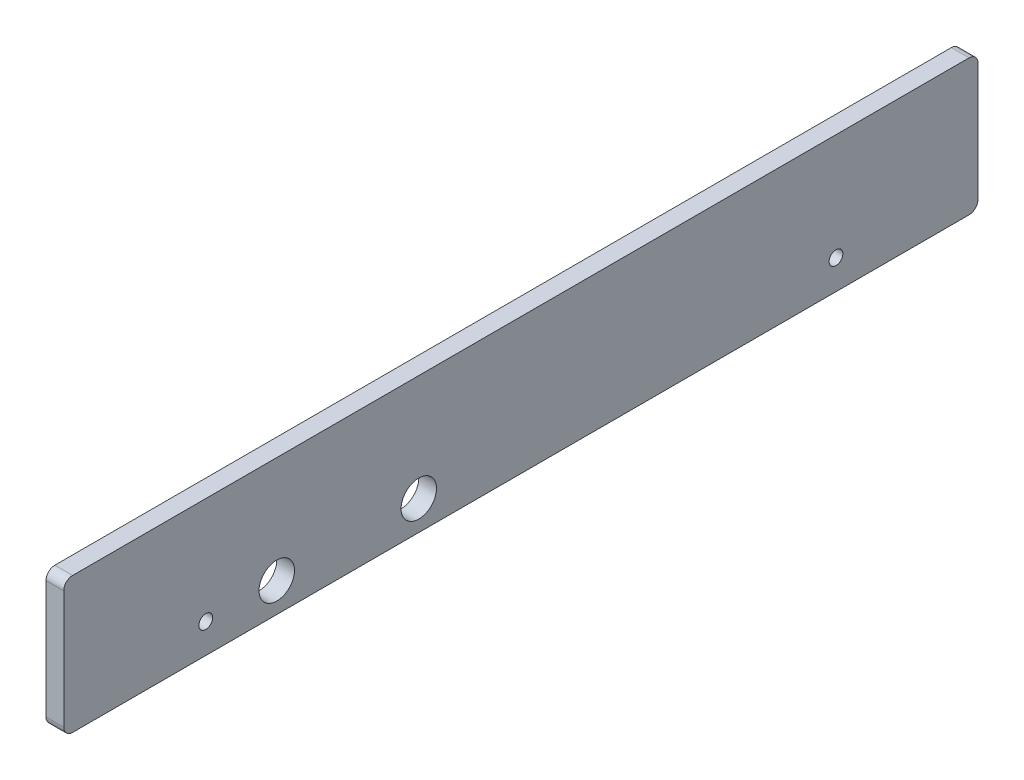
ISO-10303-21;
HEADER;
FILE_DESCRIPTION(('STEP AP214'),'2;1');
FILE_NAME('part.step','',(''),(''),'','','');
FILE_SCHEMA(('AUTOMOTIVE_DESIGN { 1 0 10303 214 1 1 1 1 }'));
ENDSEC;
DATA;
#1=APPLICATION_CONTEXT('core data for automotive mechanical design processes');
#2=APPLICATION_PROTOCOL_DEFINITION('international standard','automotive_design',2000,#1);
#3=PRODUCT_CONTEXT('',#1,'mechanical');
#4=PRODUCT('Part','Part','',(#3));
#5=PRODUCT_RELATED_PRODUCT_CATEGORY('part','',(#4));
#6=PRODUCT_DEFINITION_FORMATION('','',#4);
#7=PRODUCT_DEFINITION_CONTEXT('part definition',#1,'design');
#8=PRODUCT_DEFINITION('design','',#6,#7);
#9=PRODUCT_DEFINITION_SHAPE('','',#8);
#10=(LENGTH_UNIT() NAMED_UNIT(*) SI_UNIT(.MILLI.,.METRE.));
#11=(NAMED_UNIT(*) PLANE_ANGLE_UNIT() SI_UNIT($,.RADIAN.));
#12=(NAMED_UNIT(*) SI_UNIT($,.STERADIAN.) SOLID_ANGLE_UNIT());
#13=UNCERTAINTY_MEASURE_WITH_UNIT(LENGTH_MEASURE(1.E-05),#10,'distance_accuracy_value','');
#14=(GEOMETRIC_REPRESENTATION_CONTEXT(3) GLOBAL_UNCERTAINTY_ASSIGNED_CONTEXT((#13)) GLOBAL_UNIT_ASSIGNED_CONTEXT((#10,
#11,#12)) REPRESENTATION_CONTEXT('',''));
#15=CARTESIAN_POINT('',(0.,0.,0.));
#16=DIRECTION('',(0.,0.,1.));
#17=DIRECTION('',(1.,0.,0.));
#18=AXIS2_PLACEMENT_3D('',#15,#16,#17);
#19=CARTESIAN_POINT('',(6.35,0.,0.));
#20=DIRECTION('',(-1.,0.,0.));
#21=DIRECTION('',(0.,0.,1.));
#22=AXIS2_PLACEMENT_3D('',#19,#20,#21);
#23=PLANE('',#22);
#24=DIRECTION('',(0.,1.,0.));
#25=VECTOR('',#24,1.);
#26=CARTESIAN_POINT('',(6.35,0.,-327.025));
#27=LINE('',#26,#25);
#28=CARTESIAN_POINT('',(6.35,3.175,-327.025));
#29=VERTEX_POINT('',#28);
#30=CARTESIAN_POINT('',(6.35,45.46092,-327.025));
#31=VERTEX_POINT('',#30);
#32=EDGE_CURVE('E172',#29,#31,#27,.T.);
#33=ORIENTED_EDGE('',*,*,#32,.T.);
#34=CARTESIAN_POINT('',(6.35,45.46092,-323.85));
#35=DIRECTION('',(-1.,0.,0.));
#36=DIRECTION('',(0.,0.,1.));
#37=AXIS2_PLACEMENT_3D('',#34,#35,#36);
#38=CIRCLE('',#37,3.175);
#39=CARTESIAN_POINT('',(6.35,48.63592,-323.85));
#40=VERTEX_POINT('',#39);
#41=EDGE_CURVE('E149',#31,#40,#38,.F.);
#42=ORIENTED_EDGE('',*,*,#41,.T.);
#43=DIRECTION('',(0.,0.,1.));
#44=VECTOR('',#43,1.);
#45=CARTESIAN_POINT('',(6.35,48.63592,0.));
#46=LINE('',#45,#44);
#47=CARTESIAN_POINT('',(6.35,48.63592,-3.175));
#48=VERTEX_POINT('',#47);
#49=EDGE_CURVE('E120',#40,#48,#46,.T.);
#50=ORIENTED_EDGE('',*,*,#49,.T.);
#51=CARTESIAN_POINT('',(6.35,45.46092,-3.175));
#52=DIRECTION('',(-1.,0.,0.));
#53=DIRECTION('',(0.,0.,1.));
#54=AXIS2_PLACEMENT_3D('',#51,#52,#53);
#55=CIRCLE('',#54,3.175);
#56=CARTESIAN_POINT('',(6.35,45.46092,0.));
#57=VERTEX_POINT('',#56);
#58=EDGE_CURVE('E144',#48,#57,#55,.F.);
#59=ORIENTED_EDGE('',*,*,#58,.T.);
#60=DIRECTION('',(0.,-1.,0.));
#61=VECTOR('',#60,1.);
#62=CARTESIAN_POINT('',(6.35,0.,0.));
#63=LINE('',#62,#61);
#64=CARTESIAN_POINT('',(6.35,3.175,0.));
#65=VERTEX_POINT('',#64);
#66=EDGE_CURVE('E127',#57,#65,#63,.T.);
#67=ORIENTED_EDGE('',*,*,#66,.T.);
#68=CARTESIAN_POINT('',(6.35,3.175,-3.175));
#69=DIRECTION('',(-1.,0.,0.));
#70=DIRECTION('',(0.,0.,1.));
#71=AXIS2_PLACEMENT_3D('',#68,#69,#70);
#72=CIRCLE('',#71,3.175);
#73=CARTESIAN_POINT('',(6.35,0.,-3.175));
#74=VERTEX_POINT('',#73);
#75=EDGE_CURVE('E56',#65,#74,#72,.F.);
#76=ORIENTED_EDGE('',*,*,#75,.T.);
#77=DIRECTION('',(0.,0.,-1.));
#78=VECTOR('',#77,1.);
#79=CARTESIAN_POINT('',(6.35,0.,0.));
#80=LINE('',#79,#78);
#81=CARTESIAN_POINT('',(6.35,0.,-323.85));
#82=VERTEX_POINT('',#81);
#83=EDGE_CURVE('E130',#74,#82,#80,.T.);
#84=ORIENTED_EDGE('',*,*,#83,.T.);
#85=CARTESIAN_POINT('',(6.35,3.175,-323.85));
#86=DIRECTION('',(-1.,0.,0.));
#87=DIRECTION('',(0.,0.,1.));
#88=AXIS2_PLACEMENT_3D('',#85,#86,#87);
#89=CIRCLE('',#88,3.175);
#90=EDGE_CURVE('E147',#82,#29,#89,.F.);
#91=ORIENTED_EDGE('',*,*,#90,.T.);
#92=EDGE_LOOP('',(#33,#42,#50,#59,#67,#76,#84,#91));
#93=FACE_BOUND('',#92,.T.);
#94=CARTESIAN_POINT('',(6.35,10.53592,-50.8));
#95=DIRECTION('',(1.,0.,0.));
#96=DIRECTION('',(0.,0.,-1.));
#97=AXIS2_PLACEMENT_3D('',#94,#95,#96);
#98=CIRCLE('',#97,2.45745);
#99=CARTESIAN_POINT('',(6.35,10.53592,-53.25745));
#100=VERTEX_POINT('',#99);
#101=EDGE_CURVE('E165',#100,#100,#98,.T.);
#102=ORIENTED_EDGE('',*,*,#101,.F.);
#103=EDGE_LOOP('',(#102));
#104=FACE_BOUND('',#103,.T.);
#105=CARTESIAN_POINT('',(6.35,10.53592,-276.225));
#106=DIRECTION('',(1.,0.,0.));
#107=DIRECTION('',(0.,0.,-1.));
#108=AXIS2_PLACEMENT_3D('',#105,#106,#107);
#109=CIRCLE('',#108,2.45745000000002);
#110=CARTESIAN_POINT('',(6.35,10.53592,-278.68245));
#111=VERTEX_POINT('',#110);
#112=EDGE_CURVE('E177',#111,#111,#109,.T.);
#113=ORIENTED_EDGE('',*,*,#112,.F.);
#114=EDGE_LOOP('',(#113));
#115=FACE_BOUND('',#114,.T.);
#116=CARTESIAN_POINT('',(6.35,10.53592,-76.2));
#117=DIRECTION('',(1.,0.,0.));
#118=DIRECTION('',(0.,0.,-1.));
#119=AXIS2_PLACEMENT_3D('',#116,#117,#118);
#120=CIRCLE('',#119,6.35);
#121=CARTESIAN_POINT('',(6.35,10.53592,-82.55));
#122=VERTEX_POINT('',#121);
#123=EDGE_CURVE('E182',#122,#122,#120,.T.);
#124=ORIENTED_EDGE('',*,*,#123,.F.);
#125=EDGE_LOOP('',(#124));
#126=FACE_BOUND('',#125,.T.);
#127=CARTESIAN_POINT('',(6.35,10.53592,-127.));
#128=DIRECTION('',(1.,0.,0.));
#129=DIRECTION('',(0.,0.,-1.));
#130=AXIS2_PLACEMENT_3D('',#127,#128,#129);
#131=CIRCLE('',#130,6.35);
#132=CARTESIAN_POINT('',(6.35,10.53592,-133.35));
#133=VERTEX_POINT('',#132);
#134=EDGE_CURVE('E188',#133,#133,#131,.T.);
#135=ORIENTED_EDGE('',*,*,#134,.F.);
#136=EDGE_LOOP('',(#135));
#137=FACE_BOUND('',#136,.T.);
#138=ADVANCED_FACE('F34',(#93,#104,#115,#126,#137),#23,.F.);
#139=CARTESIAN_POINT('',(0.,0.,0.));
#140=DIRECTION('',(-1.,0.,0.));
#141=DIRECTION('',(0.,0.,1.));
#142=AXIS2_PLACEMENT_3D('',#139,#140,#141);
#143=PLANE('',#142);
#144=CARTESIAN_POINT('',(0.,10.53592,-76.2));
#145=DIRECTION('',(1.,0.,0.));
#146=DIRECTION('',(0.,0.,-1.));
#147=AXIS2_PLACEMENT_3D('',#144,#145,#146);
#148=CIRCLE('',#147,6.35);
#149=CARTESIAN_POINT('',(0.,10.53592,-82.55));
#150=VERTEX_POINT('',#149);
#151=EDGE_CURVE('E185',#150,#150,#148,.T.);
#152=ORIENTED_EDGE('',*,*,#151,.T.);
#153=EDGE_LOOP('',(#152));
#154=FACE_BOUND('',#153,.T.);
#155=CARTESIAN_POINT('',(0.,10.53592,-50.8));
#156=DIRECTION('',(1.,0.,0.));
#157=DIRECTION('',(0.,0.,-1.));
#158=AXIS2_PLACEMENT_3D('',#155,#156,#157);
#159=CIRCLE('',#158,2.45745);
#160=CARTESIAN_POINT('',(0.,10.53592,-53.25745));
#161=VERTEX_POINT('',#160);
#162=EDGE_CURVE('E168',#161,#161,#159,.T.);
#163=ORIENTED_EDGE('',*,*,#162,.T.);
#164=EDGE_LOOP('',(#163));
#165=FACE_BOUND('',#164,.T.);
#166=DIRECTION('',(0.,0.,1.));
#167=VECTOR('',#166,1.);
#168=CARTESIAN_POINT('',(0.,48.63592,0.));
#169=LINE('',#168,#167);
#170=CARTESIAN_POINT('',(0.,48.63592,-323.85));
#171=VERTEX_POINT('',#170);
#172=CARTESIAN_POINT('',(0.,48.63592,-3.175));
#173=VERTEX_POINT('',#172);
#174=EDGE_CURVE('E117',#171,#173,#169,.T.);
#175=ORIENTED_EDGE('',*,*,#174,.F.);
#176=CARTESIAN_POINT('',(0.,45.46092,-323.85));
#177=DIRECTION('',(-1.,0.,0.));
#178=DIRECTION('',(0.,0.,1.));
#179=AXIS2_PLACEMENT_3D('',#176,#177,#178);
#180=CIRCLE('',#179,3.175);
#181=CARTESIAN_POINT('',(0.,45.46092,-327.025));
#182=VERTEX_POINT('',#181);
#183=EDGE_CURVE('E100',#171,#182,#180,.T.);
#184=ORIENTED_EDGE('',*,*,#183,.T.);
#185=DIRECTION('',(0.,1.,0.));
#186=VECTOR('',#185,1.);
#187=CARTESIAN_POINT('',(0.,0.,-327.025));
#188=LINE('',#187,#186);
#189=CARTESIAN_POINT('',(0.,3.175,-327.025));
#190=VERTEX_POINT('',#189);
#191=EDGE_CURVE('E128',#190,#182,#188,.T.);
#192=ORIENTED_EDGE('',*,*,#191,.F.);
#193=CARTESIAN_POINT('',(0.,3.175,-323.85));
#194=DIRECTION('',(-1.,0.,0.));
#195=DIRECTION('',(0.,0.,1.));
#196=AXIS2_PLACEMENT_3D('',#193,#194,#195);
#197=CIRCLE('',#196,3.175);
#198=CARTESIAN_POINT('',(0.,0.,-323.85));
#199=VERTEX_POINT('',#198);
#200=EDGE_CURVE('E111',#190,#199,#197,.T.);
#201=ORIENTED_EDGE('',*,*,#200,.T.);
#202=DIRECTION('',(0.,0.,-1.));
#203=VECTOR('',#202,1.);
#204=CARTESIAN_POINT('',(0.,0.,0.));
#205=LINE('',#204,#203);
#206=CARTESIAN_POINT('',(0.,0.,-3.175));
#207=VERTEX_POINT('',#206);
#208=EDGE_CURVE('E132',#207,#199,#205,.T.);
#209=ORIENTED_EDGE('',*,*,#208,.F.);
#210=CARTESIAN_POINT('',(0.,3.175,-3.175));
#211=DIRECTION('',(-1.,0.,0.));
#212=DIRECTION('',(0.,0.,1.));
#213=AXIS2_PLACEMENT_3D('',#210,#211,#212);
#214=CIRCLE('',#213,3.175);
#215=CARTESIAN_POINT('',(0.,3.175,0.));
#216=VERTEX_POINT('',#215);
#217=EDGE_CURVE('E138',#207,#216,#214,.T.);
#218=ORIENTED_EDGE('',*,*,#217,.T.);
#219=DIRECTION('',(0.,-1.,0.));
#220=VECTOR('',#219,1.);
#221=CARTESIAN_POINT('',(0.,0.,0.));
#222=LINE('',#221,#220);
#223=CARTESIAN_POINT('',(0.,45.46092,0.));
#224=VERTEX_POINT('',#223);
#225=EDGE_CURVE('E160',#224,#216,#222,.T.);
#226=ORIENTED_EDGE('',*,*,#225,.F.);
#227=CARTESIAN_POINT('',(0.,45.46092,-3.175));
#228=DIRECTION('',(-1.,0.,0.));
#229=DIRECTION('',(0.,0.,1.));
#230=AXIS2_PLACEMENT_3D('',#227,#228,#229);
#231=CIRCLE('',#230,3.175);
#232=EDGE_CURVE('E121',#224,#173,#231,.T.);
#233=ORIENTED_EDGE('',*,*,#232,.T.);
#234=EDGE_LOOP('',(#175,#184,#192,#201,#209,#218,#226,#233));
#235=FACE_BOUND('',#234,.T.);
#236=CARTESIAN_POINT('',(0.,10.53592,-276.225));
#237=DIRECTION('',(1.,0.,0.));
#238=DIRECTION('',(0.,0.,-1.));
#239=AXIS2_PLACEMENT_3D('',#236,#237,#238);
#240=CIRCLE('',#239,2.45745000000002);
#241=CARTESIAN_POINT('',(0.,10.53592,-278.68245));
#242=VERTEX_POINT('',#241);
#243=EDGE_CURVE('E179',#242,#242,#240,.T.);
#244=ORIENTED_EDGE('',*,*,#243,.T.);
#245=EDGE_LOOP('',(#244));
#246=FACE_BOUND('',#245,.T.);
#247=CARTESIAN_POINT('',(0.,10.53592,-127.));
#248=DIRECTION('',(1.,0.,0.));
#249=DIRECTION('',(0.,0.,-1.));
#250=AXIS2_PLACEMENT_3D('',#247,#248,#249);
#251=CIRCLE('',#250,6.35);
#252=CARTESIAN_POINT('',(0.,10.53592,-133.35));
#253=VERTEX_POINT('',#252);
#254=EDGE_CURVE('E191',#253,#253,#251,.T.);
#255=ORIENTED_EDGE('',*,*,#254,.T.);
#256=EDGE_LOOP('',(#255));
#257=FACE_BOUND('',#256,.T.);
#258=ADVANCED_FACE('F124',(#154,#165,#235,#246,#257),#143,.T.);
#259=CARTESIAN_POINT('',(6.35,0.,0.));
#260=DIRECTION('',(0.,0.,-1.));
#261=DIRECTION('',(-1.,0.,0.));
#262=AXIS2_PLACEMENT_3D('',#259,#260,#261);
#263=PLANE('',#262);
#264=ORIENTED_EDGE('',*,*,#225,.T.);
#265=DIRECTION('',(-1.,0.,0.));
#266=VECTOR('',#265,1.);
#267=CARTESIAN_POINT('',(6.35,3.175,0.));
#268=LINE('',#267,#266);
#269=EDGE_CURVE('E11',#216,#65,#268,.F.);
#270=ORIENTED_EDGE('',*,*,#269,.T.);
#271=ORIENTED_EDGE('',*,*,#66,.F.);
#272=DIRECTION('',(-1.,0.,0.));
#273=VECTOR('',#272,1.);
#274=CARTESIAN_POINT('',(6.35,45.46092,0.));
#275=LINE('',#274,#273);
#276=EDGE_CURVE('E42',#57,#224,#275,.T.);
#277=ORIENTED_EDGE('',*,*,#276,.T.);
#278=EDGE_LOOP('',(#264,#270,#271,#277));
#279=FACE_BOUND('',#278,.T.);
#280=ADVANCED_FACE('F159',(#279),#263,.F.);
#281=CARTESIAN_POINT('',(6.35,0.,0.));
#282=DIRECTION('',(0.,1.,0.));
#283=DIRECTION('',(0.,0.,1.));
#284=AXIS2_PLACEMENT_3D('',#281,#282,#283);
#285=PLANE('',#284);
#286=ORIENTED_EDGE('',*,*,#208,.T.);
#287=DIRECTION('',(-1.,0.,0.));
#288=VECTOR('',#287,1.);
#289=CARTESIAN_POINT('',(6.35,0.,-323.85));
#290=LINE('',#289,#288);
#291=EDGE_CURVE('E49',#199,#82,#290,.F.);
#292=ORIENTED_EDGE('',*,*,#291,.T.);
#293=ORIENTED_EDGE('',*,*,#83,.F.);
#294=DIRECTION('',(-1.,0.,0.));
#295=VECTOR('',#294,1.);
#296=CARTESIAN_POINT('',(6.35,0.,-3.175));
#297=LINE('',#296,#295);
#298=EDGE_CURVE('E151',#74,#207,#297,.T.);
#299=ORIENTED_EDGE('',*,*,#298,.T.);
#300=EDGE_LOOP('',(#286,#292,#293,#299));
#301=FACE_BOUND('',#300,.T.);
#302=ADVANCED_FACE('F217',(#301),#285,.F.);
#303=CARTESIAN_POINT('',(6.35,0.,-327.025));
#304=DIRECTION('',(0.,0.,1.));
#305=DIRECTION('',(1.,0.,0.));
#306=AXIS2_PLACEMENT_3D('',#303,#304,#305);
#307=PLANE('',#306);
#308=ORIENTED_EDGE('',*,*,#191,.T.);
#309=DIRECTION('',(-1.,0.,0.));
#310=VECTOR('',#309,1.);
#311=CARTESIAN_POINT('',(6.35,45.46092,-327.025));
#312=LINE('',#311,#310);
#313=EDGE_CURVE('E105',#182,#31,#312,.F.);
#314=ORIENTED_EDGE('',*,*,#313,.T.);
#315=ORIENTED_EDGE('',*,*,#32,.F.);
#316=DIRECTION('',(-1.,0.,0.));
#317=VECTOR('',#316,1.);
#318=CARTESIAN_POINT('',(6.35,3.175,-327.025));
#319=LINE('',#318,#317);
#320=EDGE_CURVE('E110',#29,#190,#319,.T.);
#321=ORIENTED_EDGE('',*,*,#320,.T.);
#322=EDGE_LOOP('',(#308,#314,#315,#321));
#323=FACE_BOUND('',#322,.T.);
#324=ADVANCED_FACE('F214',(#323),#307,.F.);
#325=CARTESIAN_POINT('',(6.35,48.63592,0.));
#326=DIRECTION('',(0.,-1.,0.));
#327=DIRECTION('',(0.,0.,-1.));
#328=AXIS2_PLACEMENT_3D('',#325,#326,#327);
#329=PLANE('',#328);
#330=ORIENTED_EDGE('',*,*,#49,.F.);
#331=DIRECTION('',(-1.,0.,0.));
#332=VECTOR('',#331,1.);
#333=CARTESIAN_POINT('',(6.35,48.63592,-323.85));
#334=LINE('',#333,#332);
#335=EDGE_CURVE('E104',#40,#171,#334,.T.);
#336=ORIENTED_EDGE('',*,*,#335,.T.);
#337=ORIENTED_EDGE('',*,*,#174,.T.);
#338=DIRECTION('',(-1.,0.,0.));
#339=VECTOR('',#338,1.);
#340=CARTESIAN_POINT('',(6.35,48.63592,-3.175));
#341=LINE('',#340,#339);
#342=EDGE_CURVE('E122',#173,#48,#341,.F.);
#343=ORIENTED_EDGE('',*,*,#342,.T.);
#344=EDGE_LOOP('',(#330,#336,#337,#343));
#345=FACE_BOUND('',#344,.T.);
#346=ADVANCED_FACE('F116',(#345),#329,.F.);
#347=CARTESIAN_POINT('',(6.35,10.53592,-50.8));
#348=DIRECTION('',(-1.,0.,0.));
#349=DIRECTION('',(0.,0.,1.));
#350=AXIS2_PLACEMENT_3D('',#347,#348,#349);
#351=CYLINDRICAL_SURFACE('',#350,2.45745);
#352=ORIENTED_EDGE('',*,*,#101,.T.);
#353=EDGE_LOOP('',(#352));
#354=FACE_BOUND('',#353,.T.);
#355=ORIENTED_EDGE('',*,*,#162,.F.);
#356=EDGE_LOOP('',(#355));
#357=FACE_BOUND('',#356,.T.);
#358=ADVANCED_FACE('F209',(#354,#357),#351,.F.);
#359=CARTESIAN_POINT('',(6.35,10.53592,-276.225));
#360=DIRECTION('',(-1.,0.,0.));
#361=DIRECTION('',(0.,0.,1.));
#362=AXIS2_PLACEMENT_3D('',#359,#360,#361);
#363=CYLINDRICAL_SURFACE('',#362,2.45745000000002);
#364=ORIENTED_EDGE('',*,*,#112,.T.);
#365=EDGE_LOOP('',(#364));
#366=FACE_BOUND('',#365,.T.);
#367=ORIENTED_EDGE('',*,*,#243,.F.);
#368=EDGE_LOOP('',(#367));
#369=FACE_BOUND('',#368,.T.);
#370=ADVANCED_FACE('F310',(#366,#369),#363,.F.);
#371=CARTESIAN_POINT('',(6.35,10.53592,-76.2));
#372=DIRECTION('',(-1.,0.,0.));
#373=DIRECTION('',(0.,0.,1.));
#374=AXIS2_PLACEMENT_3D('',#371,#372,#373);
#375=CYLINDRICAL_SURFACE('',#374,6.35);
#376=ORIENTED_EDGE('',*,*,#123,.T.);
#377=EDGE_LOOP('',(#376));
#378=FACE_BOUND('',#377,.T.);
#379=ORIENTED_EDGE('',*,*,#151,.F.);
#380=EDGE_LOOP('',(#379));
#381=FACE_BOUND('',#380,.T.);
#382=ADVANCED_FACE('F301',(#378,#381),#375,.F.);
#383=CARTESIAN_POINT('',(6.35,10.53592,-127.));
#384=DIRECTION('',(-1.,0.,0.));
#385=DIRECTION('',(0.,0.,1.));
#386=AXIS2_PLACEMENT_3D('',#383,#384,#385);
#387=CYLINDRICAL_SURFACE('',#386,6.35);
#388=ORIENTED_EDGE('',*,*,#134,.T.);
#389=EDGE_LOOP('',(#388));
#390=FACE_BOUND('',#389,.T.);
#391=ORIENTED_EDGE('',*,*,#254,.F.);
#392=EDGE_LOOP('',(#391));
#393=FACE_BOUND('',#392,.T.);
#394=ADVANCED_FACE('F197',(#390,#393),#387,.F.);
#395=CARTESIAN_POINT('',(6.35,45.46092,-323.85));
#396=DIRECTION('',(-1.,0.,0.));
#397=DIRECTION('',(0.,0.,1.));
#398=AXIS2_PLACEMENT_3D('',#395,#396,#397);
#399=CYLINDRICAL_SURFACE('',#398,3.175);
#400=ORIENTED_EDGE('',*,*,#41,.F.);
#401=ORIENTED_EDGE('',*,*,#313,.F.);
#402=ORIENTED_EDGE('',*,*,#183,.F.);
#403=ORIENTED_EDGE('',*,*,#335,.F.);
#404=EDGE_LOOP('',(#400,#401,#402,#403));
#405=FACE_BOUND('',#404,.T.);
#406=ADVANCED_FACE('F103',(#405),#399,.T.);
#407=CARTESIAN_POINT('',(6.35,3.175,-323.85));
#408=DIRECTION('',(-1.,0.,0.));
#409=DIRECTION('',(0.,0.,1.));
#410=AXIS2_PLACEMENT_3D('',#407,#408,#409);
#411=CYLINDRICAL_SURFACE('',#410,3.175);
#412=ORIENTED_EDGE('',*,*,#90,.F.);
#413=ORIENTED_EDGE('',*,*,#291,.F.);
#414=ORIENTED_EDGE('',*,*,#200,.F.);
#415=ORIENTED_EDGE('',*,*,#320,.F.);
#416=EDGE_LOOP('',(#412,#413,#414,#415));
#417=FACE_BOUND('',#416,.T.);
#418=ADVANCED_FACE('F225',(#417),#411,.T.);
#419=CARTESIAN_POINT('',(6.35,3.175,-3.175));
#420=DIRECTION('',(-1.,0.,0.));
#421=DIRECTION('',(0.,0.,1.));
#422=AXIS2_PLACEMENT_3D('',#419,#420,#421);
#423=CYLINDRICAL_SURFACE('',#422,3.175);
#424=ORIENTED_EDGE('',*,*,#75,.F.);
#425=ORIENTED_EDGE('',*,*,#269,.F.);
#426=ORIENTED_EDGE('',*,*,#217,.F.);
#427=ORIENTED_EDGE('',*,*,#298,.F.);
#428=EDGE_LOOP('',(#424,#425,#426,#427));
#429=FACE_BOUND('',#428,.T.);
#430=ADVANCED_FACE('F227',(#429),#423,.T.);
#431=CARTESIAN_POINT('',(6.35,45.46092,-3.175));
#432=DIRECTION('',(-1.,0.,0.));
#433=DIRECTION('',(0.,0.,1.));
#434=AXIS2_PLACEMENT_3D('',#431,#432,#433);
#435=CYLINDRICAL_SURFACE('',#434,3.175);
#436=ORIENTED_EDGE('',*,*,#58,.F.);
#437=ORIENTED_EDGE('',*,*,#342,.F.);
#438=ORIENTED_EDGE('',*,*,#232,.F.);
#439=ORIENTED_EDGE('',*,*,#276,.F.);
#440=EDGE_LOOP('',(#436,#437,#438,#439));
#441=FACE_BOUND('',#440,.T.);
#442=ADVANCED_FACE('F36',(#441),#435,.T.);
#443=CLOSED_SHELL('',(#138,#258,#280,#302,#324,#346,#358,#370,#382,#394,#406,#418,#430,#442));
#444=MANIFOLD_SOLID_BREP('B2',#443);
#445=ADVANCED_BREP_SHAPE_REPRESENTATION('',(#18,#444),#14);
#446=SHAPE_DEFINITION_REPRESENTATION(#9,#445);
ENDSEC;
END-ISO-10303-21;
